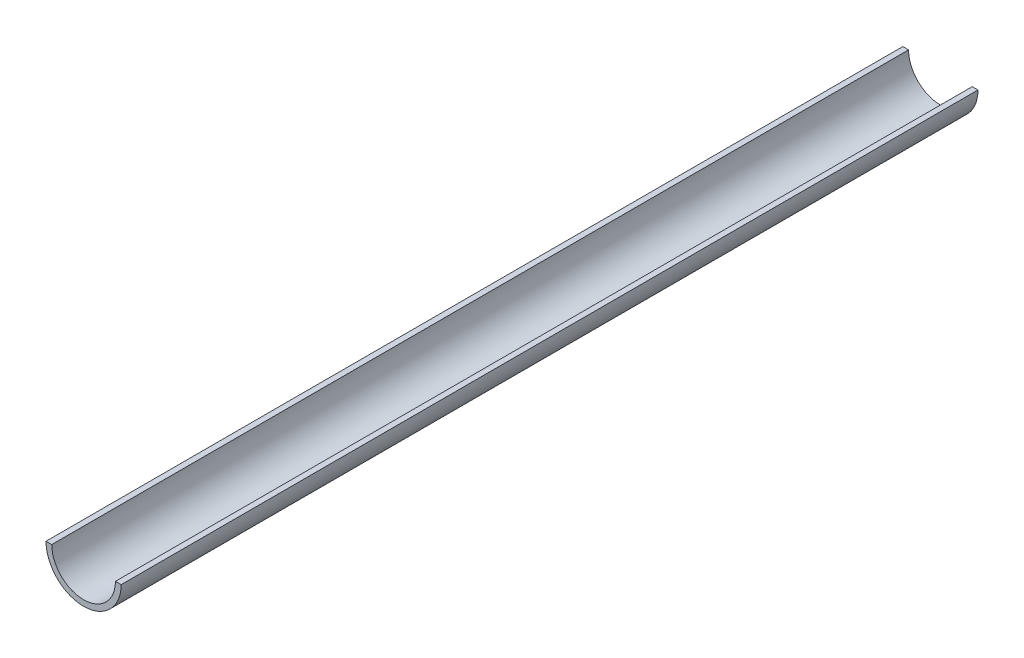
ISO-10303-21;
HEADER;
FILE_DESCRIPTION(('STEP AP214'),'2;1');
FILE_NAME('part.step','',(''),(''),'','','');
FILE_SCHEMA(('AUTOMOTIVE_DESIGN { 1 0 10303 214 1 1 1 1 }'));
ENDSEC;
DATA;
#1=APPLICATION_CONTEXT('core data for automotive mechanical design processes');
#2=APPLICATION_PROTOCOL_DEFINITION('international standard','automotive_design',2000,#1);
#3=PRODUCT_CONTEXT('',#1,'mechanical');
#4=PRODUCT('Part','Part','',(#3));
#5=PRODUCT_RELATED_PRODUCT_CATEGORY('part','',(#4));
#6=PRODUCT_DEFINITION_FORMATION('','',#4);
#7=PRODUCT_DEFINITION_CONTEXT('part definition',#1,'design');
#8=PRODUCT_DEFINITION('design','',#6,#7);
#9=PRODUCT_DEFINITION_SHAPE('','',#8);
#10=(LENGTH_UNIT() NAMED_UNIT(*) SI_UNIT(.MILLI.,.METRE.));
#11=(NAMED_UNIT(*) PLANE_ANGLE_UNIT() SI_UNIT($,.RADIAN.));
#12=(NAMED_UNIT(*) SI_UNIT($,.STERADIAN.) SOLID_ANGLE_UNIT());
#13=UNCERTAINTY_MEASURE_WITH_UNIT(LENGTH_MEASURE(1.E-05),#10,'distance_accuracy_value','');
#14=(GEOMETRIC_REPRESENTATION_CONTEXT(3) GLOBAL_UNCERTAINTY_ASSIGNED_CONTEXT((#13)) GLOBAL_UNIT_ASSIGNED_CONTEXT((#10,
#11,#12)) REPRESENTATION_CONTEXT('',''));
#15=CARTESIAN_POINT('',(0.,0.,0.));
#16=DIRECTION('',(0.,0.,1.));
#17=DIRECTION('',(1.,0.,0.));
#18=AXIS2_PLACEMENT_3D('',#15,#16,#17);
#19=CARTESIAN_POINT('',(0.,0.,275.07));
#20=DIRECTION('',(0.,0.,-1.));
#21=DIRECTION('',(-1.,0.,0.));
#22=AXIS2_PLACEMENT_3D('',#19,#20,#21);
#23=CYLINDRICAL_SURFACE('',#22,20.445);
#24=CARTESIAN_POINT('',(0.,0.,-275.07));
#25=DIRECTION('',(0.,0.,-1.));
#26=DIRECTION('',(1.,0.,0.));
#27=AXIS2_PLACEMENT_3D('',#24,#25,#26);
#28=CIRCLE('',#27,20.445);
#29=CARTESIAN_POINT('',(20.445,0.,-275.07));
#30=VERTEX_POINT('',#29);
#31=CARTESIAN_POINT('',(-20.445,0.,-275.07));
#32=VERTEX_POINT('',#31);
#33=EDGE_CURVE('E113',#30,#32,#28,.T.);
#34=ORIENTED_EDGE('',*,*,#33,.T.);
#35=DIRECTION('',(0.,0.,-1.));
#36=VECTOR('',#35,1.);
#37=CARTESIAN_POINT('',(-20.445,0.,275.07));
#38=LINE('',#37,#36);
#39=CARTESIAN_POINT('',(-20.445,0.,275.07));
#40=VERTEX_POINT('',#39);
#41=EDGE_CURVE('E11',#40,#32,#38,.T.);
#42=ORIENTED_EDGE('',*,*,#41,.F.);
#43=CARTESIAN_POINT('',(0.,0.,275.07));
#44=DIRECTION('',(0.,0.,-1.));
#45=DIRECTION('',(1.,0.,0.));
#46=AXIS2_PLACEMENT_3D('',#43,#44,#45);
#47=CIRCLE('',#46,20.445);
#48=CARTESIAN_POINT('',(20.445,0.,275.07));
#49=VERTEX_POINT('',#48);
#50=EDGE_CURVE('E97',#49,#40,#47,.T.);
#51=ORIENTED_EDGE('',*,*,#50,.F.);
#52=DIRECTION('',(0.,0.,-1.));
#53=VECTOR('',#52,1.);
#54=CARTESIAN_POINT('',(20.445,0.,275.07));
#55=LINE('',#54,#53);
#56=EDGE_CURVE('E109',#49,#30,#55,.T.);
#57=ORIENTED_EDGE('',*,*,#56,.T.);
#58=EDGE_LOOP('',(#34,#42,#51,#57));
#59=FACE_BOUND('',#58,.T.);
#60=ADVANCED_FACE('F45',(#59),#23,.F.);
#61=CARTESIAN_POINT('',(-24.13,0.,275.07));
#62=DIRECTION('',(0.,-1.,0.));
#63=DIRECTION('',(0.,0.,-1.));
#64=AXIS2_PLACEMENT_3D('',#61,#62,#63);
#65=PLANE('',#64);
#66=DIRECTION('',(-1.,0.,0.));
#67=VECTOR('',#66,1.);
#68=CARTESIAN_POINT('',(-24.13,0.,-275.07));
#69=LINE('',#68,#67);
#70=CARTESIAN_POINT('',(-24.13,0.,-275.07));
#71=VERTEX_POINT('',#70);
#72=EDGE_CURVE('E102',#32,#71,#69,.T.);
#73=ORIENTED_EDGE('',*,*,#72,.T.);
#74=DIRECTION('',(0.,0.,-1.));
#75=VECTOR('',#74,1.);
#76=CARTESIAN_POINT('',(-24.13,0.,275.07));
#77=LINE('',#76,#75);
#78=CARTESIAN_POINT('',(-24.13,0.,275.07));
#79=VERTEX_POINT('',#78);
#80=EDGE_CURVE('E54',#79,#71,#77,.T.);
#81=ORIENTED_EDGE('',*,*,#80,.F.);
#82=DIRECTION('',(-1.,0.,0.));
#83=VECTOR('',#82,1.);
#84=CARTESIAN_POINT('',(-24.13,0.,275.07));
#85=LINE('',#84,#83);
#86=EDGE_CURVE('E92',#40,#79,#85,.T.);
#87=ORIENTED_EDGE('',*,*,#86,.F.);
#88=ORIENTED_EDGE('',*,*,#41,.T.);
#89=EDGE_LOOP('',(#73,#81,#87,#88));
#90=FACE_BOUND('',#89,.T.);
#91=ADVANCED_FACE('F101',(#90),#65,.F.);
#92=CARTESIAN_POINT('',(0.,0.,275.07));
#93=DIRECTION('',(0.,0.,-1.));
#94=DIRECTION('',(-1.,0.,0.));
#95=AXIS2_PLACEMENT_3D('',#92,#93,#94);
#96=CYLINDRICAL_SURFACE('',#95,24.13);
#97=CARTESIAN_POINT('',(0.,0.,-275.07));
#98=DIRECTION('',(0.,0.,1.));
#99=DIRECTION('',(1.,0.,0.));
#100=AXIS2_PLACEMENT_3D('',#97,#98,#99);
#101=CIRCLE('',#100,24.13);
#102=CARTESIAN_POINT('',(24.13,0.,-275.07));
#103=VERTEX_POINT('',#102);
#104=EDGE_CURVE('E79',#71,#103,#101,.T.);
#105=ORIENTED_EDGE('',*,*,#104,.T.);
#106=DIRECTION('',(0.,0.,-1.));
#107=VECTOR('',#106,1.);
#108=CARTESIAN_POINT('',(24.13,0.,275.07));
#109=LINE('',#108,#107);
#110=CARTESIAN_POINT('',(24.13,0.,275.07));
#111=VERTEX_POINT('',#110);
#112=EDGE_CURVE('E104',#111,#103,#109,.T.);
#113=ORIENTED_EDGE('',*,*,#112,.F.);
#114=CARTESIAN_POINT('',(0.,0.,275.07));
#115=DIRECTION('',(0.,0.,1.));
#116=DIRECTION('',(1.,0.,0.));
#117=AXIS2_PLACEMENT_3D('',#114,#115,#116);
#118=CIRCLE('',#117,24.13);
#119=EDGE_CURVE('E95',#79,#111,#118,.T.);
#120=ORIENTED_EDGE('',*,*,#119,.F.);
#121=ORIENTED_EDGE('',*,*,#80,.T.);
#122=EDGE_LOOP('',(#105,#113,#120,#121));
#123=FACE_BOUND('',#122,.T.);
#124=ADVANCED_FACE('F105',(#123),#96,.T.);
#125=CARTESIAN_POINT('',(20.445,0.,275.07));
#126=DIRECTION('',(0.,-1.,0.));
#127=DIRECTION('',(0.,0.,-1.));
#128=AXIS2_PLACEMENT_3D('',#125,#126,#127);
#129=PLANE('',#128);
#130=DIRECTION('',(-1.,0.,0.));
#131=VECTOR('',#130,1.);
#132=CARTESIAN_POINT('',(20.445,0.,-275.07));
#133=LINE('',#132,#131);
#134=EDGE_CURVE('E85',#103,#30,#133,.T.);
#135=ORIENTED_EDGE('',*,*,#134,.T.);
#136=ORIENTED_EDGE('',*,*,#56,.F.);
#137=DIRECTION('',(-1.,0.,0.));
#138=VECTOR('',#137,1.);
#139=CARTESIAN_POINT('',(20.445,0.,275.07));
#140=LINE('',#139,#138);
#141=EDGE_CURVE('E62',#111,#49,#140,.T.);
#142=ORIENTED_EDGE('',*,*,#141,.F.);
#143=ORIENTED_EDGE('',*,*,#112,.T.);
#144=EDGE_LOOP('',(#135,#136,#142,#143));
#145=FACE_BOUND('',#144,.T.);
#146=ADVANCED_FACE('F126',(#145),#129,.F.);
#147=CARTESIAN_POINT('',(0.,0.,275.07));
#148=DIRECTION('',(0.,0.,1.));
#149=DIRECTION('',(1.,0.,0.));
#150=AXIS2_PLACEMENT_3D('',#147,#148,#149);
#151=PLANE('',#150);
#152=ORIENTED_EDGE('',*,*,#50,.T.);
#153=ORIENTED_EDGE('',*,*,#86,.T.);
#154=ORIENTED_EDGE('',*,*,#119,.T.);
#155=ORIENTED_EDGE('',*,*,#141,.T.);
#156=EDGE_LOOP('',(#152,#153,#154,#155));
#157=FACE_BOUND('',#156,.T.);
#158=ADVANCED_FACE('F93',(#157),#151,.T.);
#159=CARTESIAN_POINT('',(0.,0.,-275.07));
#160=DIRECTION('',(0.,0.,1.));
#161=DIRECTION('',(1.,0.,0.));
#162=AXIS2_PLACEMENT_3D('',#159,#160,#161);
#163=PLANE('',#162);
#164=ORIENTED_EDGE('',*,*,#33,.F.);
#165=ORIENTED_EDGE('',*,*,#134,.F.);
#166=ORIENTED_EDGE('',*,*,#104,.F.);
#167=ORIENTED_EDGE('',*,*,#72,.F.);
#168=EDGE_LOOP('',(#164,#165,#166,#167));
#169=FACE_BOUND('',#168,.T.);
#170=ADVANCED_FACE('F129',(#169),#163,.F.);
#171=CLOSED_SHELL('',(#60,#91,#124,#146,#158,#170));
#172=MANIFOLD_SOLID_BREP('B2',#171);
#173=ADVANCED_BREP_SHAPE_REPRESENTATION('',(#18,#172),#14);
#174=SHAPE_DEFINITION_REPRESENTATION(#9,#173);
ENDSEC;
END-ISO-10303-21;
